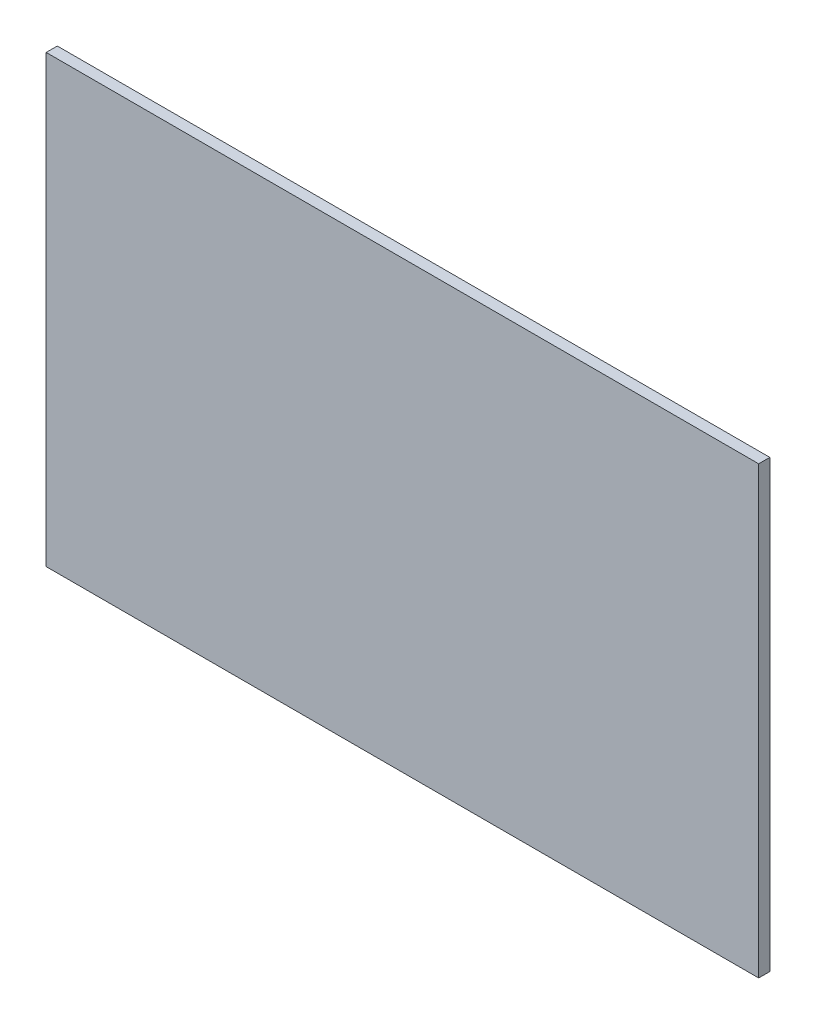
ISO-10303-21;
HEADER;
FILE_DESCRIPTION(('STEP AP214'),'2;1');
FILE_NAME('part.step','',(''),(''),'','','');
FILE_SCHEMA(('AUTOMOTIVE_DESIGN { 1 0 10303 214 1 1 1 1 }'));
ENDSEC;
DATA;
#1=APPLICATION_CONTEXT('core data for automotive mechanical design processes');
#2=APPLICATION_PROTOCOL_DEFINITION('international standard','automotive_design',2000,#1);
#3=PRODUCT_CONTEXT('',#1,'mechanical');
#4=PRODUCT('Part','Part','',(#3));
#5=PRODUCT_RELATED_PRODUCT_CATEGORY('part','',(#4));
#6=PRODUCT_DEFINITION_FORMATION('','',#4);
#7=PRODUCT_DEFINITION_CONTEXT('part definition',#1,'design');
#8=PRODUCT_DEFINITION('design','',#6,#7);
#9=PRODUCT_DEFINITION_SHAPE('','',#8);
#10=(LENGTH_UNIT() NAMED_UNIT(*) SI_UNIT(.MILLI.,.METRE.));
#11=(NAMED_UNIT(*) PLANE_ANGLE_UNIT() SI_UNIT($,.RADIAN.));
#12=(NAMED_UNIT(*) SI_UNIT($,.STERADIAN.) SOLID_ANGLE_UNIT());
#13=UNCERTAINTY_MEASURE_WITH_UNIT(LENGTH_MEASURE(1.E-05),#10,'distance_accuracy_value','');
#14=(GEOMETRIC_REPRESENTATION_CONTEXT(3) GLOBAL_UNCERTAINTY_ASSIGNED_CONTEXT((#13)) GLOBAL_UNIT_ASSIGNED_CONTEXT((#10,
#11,#12)) REPRESENTATION_CONTEXT('',''));
#15=CARTESIAN_POINT('',(0.,0.,0.));
#16=DIRECTION('',(0.,0.,1.));
#17=DIRECTION('',(1.,0.,0.));
#18=AXIS2_PLACEMENT_3D('',#15,#16,#17);
#19=CARTESIAN_POINT('',(160.,100.,-5.));
#20=DIRECTION('',(1.,0.,0.));
#21=DIRECTION('',(0.,1.,0.));
#22=AXIS2_PLACEMENT_3D('',#19,#20,#21);
#23=PLANE('',#22);
#24=DIRECTION('',(0.,1.,0.));
#25=VECTOR('',#24,1.);
#26=CARTESIAN_POINT('',(160.,100.,0.));
#27=LINE('',#26,#25);
#28=CARTESIAN_POINT('',(160.,-100.,0.));
#29=VERTEX_POINT('',#28);
#30=CARTESIAN_POINT('',(160.,100.,0.));
#31=VERTEX_POINT('',#30);
#32=EDGE_CURVE('E105',#29,#31,#27,.T.);
#33=ORIENTED_EDGE('',*,*,#32,.F.);
#34=DIRECTION('',(0.,0.,1.));
#35=VECTOR('',#34,1.);
#36=CARTESIAN_POINT('',(160.,-100.,-5.));
#37=LINE('',#36,#35);
#38=CARTESIAN_POINT('',(160.,-100.,-5.));
#39=VERTEX_POINT('',#38);
#40=EDGE_CURVE('E11',#39,#29,#37,.T.);
#41=ORIENTED_EDGE('',*,*,#40,.F.);
#42=DIRECTION('',(0.,1.,0.));
#43=VECTOR('',#42,1.);
#44=CARTESIAN_POINT('',(160.,100.,-5.));
#45=LINE('',#44,#43);
#46=CARTESIAN_POINT('',(160.,100.,-5.));
#47=VERTEX_POINT('',#46);
#48=EDGE_CURVE('E99',#39,#47,#45,.T.);
#49=ORIENTED_EDGE('',*,*,#48,.T.);
#50=DIRECTION('',(0.,0.,1.));
#51=VECTOR('',#50,1.);
#52=CARTESIAN_POINT('',(160.,100.,-5.));
#53=LINE('',#52,#51);
#54=EDGE_CURVE('E44',#47,#31,#53,.T.);
#55=ORIENTED_EDGE('',*,*,#54,.T.);
#56=EDGE_LOOP('',(#33,#41,#49,#55));
#57=FACE_BOUND('',#56,.T.);
#58=ADVANCED_FACE('F41',(#57),#23,.T.);
#59=CARTESIAN_POINT('',(-160.,-100.,-5.));
#60=DIRECTION('',(0.,-1.,0.));
#61=DIRECTION('',(0.,0.,-1.));
#62=AXIS2_PLACEMENT_3D('',#59,#60,#61);
#63=PLANE('',#62);
#64=DIRECTION('',(1.,0.,0.));
#65=VECTOR('',#64,1.);
#66=CARTESIAN_POINT('',(-160.,-100.,0.));
#67=LINE('',#66,#65);
#68=CARTESIAN_POINT('',(-160.,-100.,0.));
#69=VERTEX_POINT('',#68);
#70=EDGE_CURVE('E101',#69,#29,#67,.T.);
#71=ORIENTED_EDGE('',*,*,#70,.F.);
#72=DIRECTION('',(0.,0.,1.));
#73=VECTOR('',#72,1.);
#74=CARTESIAN_POINT('',(-160.,-100.,-5.));
#75=LINE('',#74,#73);
#76=CARTESIAN_POINT('',(-160.,-100.,-5.));
#77=VERTEX_POINT('',#76);
#78=EDGE_CURVE('E50',#77,#69,#75,.T.);
#79=ORIENTED_EDGE('',*,*,#78,.F.);
#80=DIRECTION('',(1.,0.,0.));
#81=VECTOR('',#80,1.);
#82=CARTESIAN_POINT('',(-160.,-100.,-5.));
#83=LINE('',#82,#81);
#84=EDGE_CURVE('E96',#77,#39,#83,.T.);
#85=ORIENTED_EDGE('',*,*,#84,.T.);
#86=ORIENTED_EDGE('',*,*,#40,.T.);
#87=EDGE_LOOP('',(#71,#79,#85,#86));
#88=FACE_BOUND('',#87,.T.);
#89=ADVANCED_FACE('F115',(#88),#63,.T.);
#90=CARTESIAN_POINT('',(-160.,100.,-5.));
#91=DIRECTION('',(-1.,0.,0.));
#92=DIRECTION('',(0.,-1.,0.));
#93=AXIS2_PLACEMENT_3D('',#90,#91,#92);
#94=PLANE('',#93);
#95=DIRECTION('',(0.,-1.,0.));
#96=VECTOR('',#95,1.);
#97=CARTESIAN_POINT('',(-160.,100.,0.));
#98=LINE('',#97,#96);
#99=CARTESIAN_POINT('',(-160.,100.,0.));
#100=VERTEX_POINT('',#99);
#101=EDGE_CURVE('E91',#100,#69,#98,.T.);
#102=ORIENTED_EDGE('',*,*,#101,.F.);
#103=DIRECTION('',(0.,0.,1.));
#104=VECTOR('',#103,1.);
#105=CARTESIAN_POINT('',(-160.,100.,-5.));
#106=LINE('',#105,#104);
#107=CARTESIAN_POINT('',(-160.,100.,-5.));
#108=VERTEX_POINT('',#107);
#109=EDGE_CURVE('E86',#108,#100,#106,.T.);
#110=ORIENTED_EDGE('',*,*,#109,.F.);
#111=DIRECTION('',(0.,-1.,0.));
#112=VECTOR('',#111,1.);
#113=CARTESIAN_POINT('',(-160.,100.,-5.));
#114=LINE('',#113,#112);
#115=EDGE_CURVE('E89',#108,#77,#114,.T.);
#116=ORIENTED_EDGE('',*,*,#115,.T.);
#117=ORIENTED_EDGE('',*,*,#78,.T.);
#118=EDGE_LOOP('',(#102,#110,#116,#117));
#119=FACE_BOUND('',#118,.T.);
#120=ADVANCED_FACE('F88',(#119),#94,.T.);
#121=CARTESIAN_POINT('',(-160.,100.,-5.));
#122=DIRECTION('',(0.,1.,0.));
#123=DIRECTION('',(0.,0.,1.));
#124=AXIS2_PLACEMENT_3D('',#121,#122,#123);
#125=PLANE('',#124);
#126=DIRECTION('',(-1.,0.,0.));
#127=VECTOR('',#126,1.);
#128=CARTESIAN_POINT('',(-160.,100.,0.));
#129=LINE('',#128,#127);
#130=EDGE_CURVE('E108',#31,#100,#129,.T.);
#131=ORIENTED_EDGE('',*,*,#130,.F.);
#132=ORIENTED_EDGE('',*,*,#54,.F.);
#133=DIRECTION('',(-1.,0.,0.));
#134=VECTOR('',#133,1.);
#135=CARTESIAN_POINT('',(-160.,100.,-5.));
#136=LINE('',#135,#134);
#137=EDGE_CURVE('E95',#47,#108,#136,.T.);
#138=ORIENTED_EDGE('',*,*,#137,.T.);
#139=ORIENTED_EDGE('',*,*,#109,.T.);
#140=EDGE_LOOP('',(#131,#132,#138,#139));
#141=FACE_BOUND('',#140,.T.);
#142=ADVANCED_FACE('F98',(#141),#125,.T.);
#143=CARTESIAN_POINT('',(0.,0.,-5.));
#144=DIRECTION('',(0.,0.,1.));
#145=DIRECTION('',(1.,0.,0.));
#146=AXIS2_PLACEMENT_3D('',#143,#144,#145);
#147=PLANE('',#146);
#148=ORIENTED_EDGE('',*,*,#48,.F.);
#149=ORIENTED_EDGE('',*,*,#84,.F.);
#150=ORIENTED_EDGE('',*,*,#115,.F.);
#151=ORIENTED_EDGE('',*,*,#137,.F.);
#152=EDGE_LOOP('',(#148,#149,#150,#151));
#153=FACE_BOUND('',#152,.T.);
#154=ADVANCED_FACE('F94',(#153),#147,.F.);
#155=CARTESIAN_POINT('',(0.,0.,0.));
#156=DIRECTION('',(0.,0.,1.));
#157=DIRECTION('',(1.,0.,0.));
#158=AXIS2_PLACEMENT_3D('',#155,#156,#157);
#159=PLANE('',#158);
#160=ORIENTED_EDGE('',*,*,#32,.T.);
#161=ORIENTED_EDGE('',*,*,#130,.T.);
#162=ORIENTED_EDGE('',*,*,#101,.T.);
#163=ORIENTED_EDGE('',*,*,#70,.T.);
#164=EDGE_LOOP('',(#160,#161,#162,#163));
#165=FACE_BOUND('',#164,.T.);
#166=ADVANCED_FACE('F114',(#165),#159,.T.);
#167=CLOSED_SHELL('',(#58,#89,#120,#142,#154,#166));
#168=MANIFOLD_SOLID_BREP('B2',#167);
#169=ADVANCED_BREP_SHAPE_REPRESENTATION('',(#18,#168),#14);
#170=SHAPE_DEFINITION_REPRESENTATION(#9,#169);
ENDSEC;
END-ISO-10303-21;
